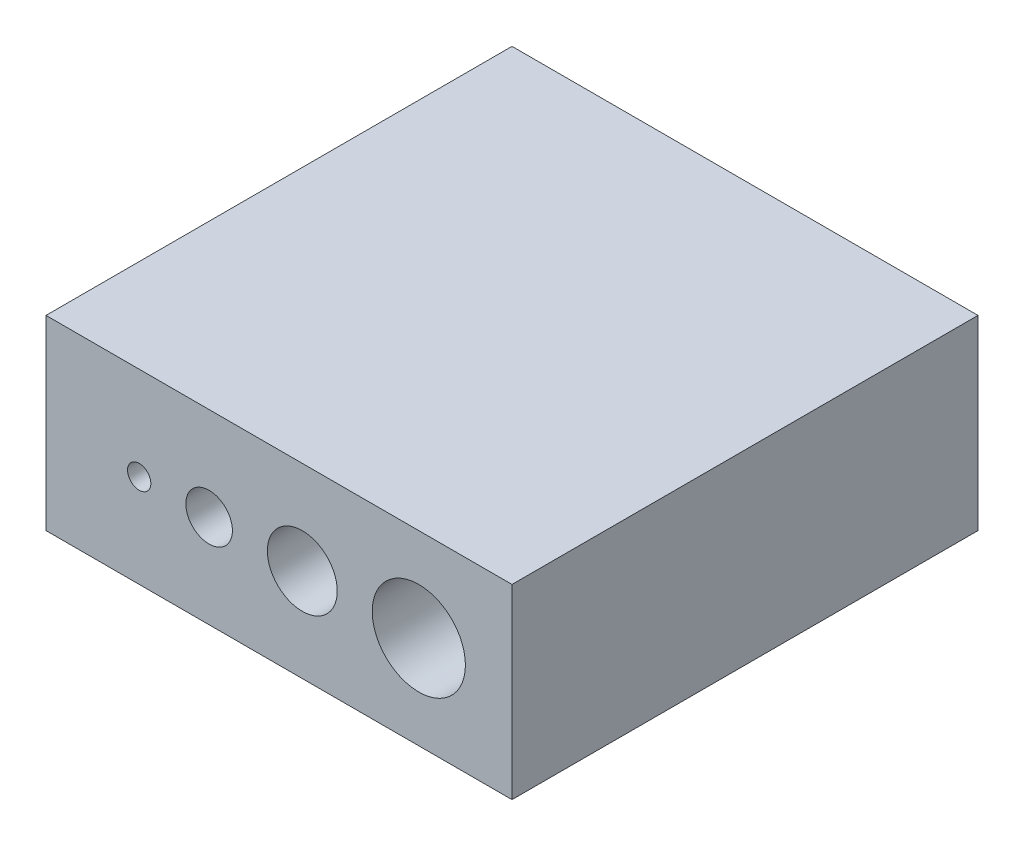
ISO-10303-21;
HEADER;
FILE_DESCRIPTION(('STEP AP214'),'2;1');
FILE_NAME('part.step','',(''),(''),'','','');
FILE_SCHEMA(('AUTOMOTIVE_DESIGN { 1 0 10303 214 1 1 1 1 }'));
ENDSEC;
DATA;
#1=APPLICATION_CONTEXT('core data for automotive mechanical design processes');
#2=APPLICATION_PROTOCOL_DEFINITION('international standard','automotive_design',2000,#1);
#3=PRODUCT_CONTEXT('',#1,'mechanical');
#4=PRODUCT('Part','Part','',(#3));
#5=PRODUCT_RELATED_PRODUCT_CATEGORY('part','',(#4));
#6=PRODUCT_DEFINITION_FORMATION('','',#4);
#7=PRODUCT_DEFINITION_CONTEXT('part definition',#1,'design');
#8=PRODUCT_DEFINITION('design','',#6,#7);
#9=PRODUCT_DEFINITION_SHAPE('','',#8);
#10=(LENGTH_UNIT() NAMED_UNIT(*) SI_UNIT(.MILLI.,.METRE.));
#11=(NAMED_UNIT(*) PLANE_ANGLE_UNIT() SI_UNIT($,.RADIAN.));
#12=(NAMED_UNIT(*) SI_UNIT($,.STERADIAN.) SOLID_ANGLE_UNIT());
#13=UNCERTAINTY_MEASURE_WITH_UNIT(LENGTH_MEASURE(1.E-05),#10,'distance_accuracy_value','');
#14=(GEOMETRIC_REPRESENTATION_CONTEXT(3) GLOBAL_UNCERTAINTY_ASSIGNED_CONTEXT((#13)) GLOBAL_UNIT_ASSIGNED_CONTEXT((#10,
#11,#12)) REPRESENTATION_CONTEXT('',''));
#15=CARTESIAN_POINT('',(0.,0.,0.));
#16=DIRECTION('',(0.,0.,1.));
#17=DIRECTION('',(1.,0.,0.));
#18=AXIS2_PLACEMENT_3D('',#15,#16,#17);
#19=CARTESIAN_POINT('',(0.,0.,-20.));
#20=DIRECTION('',(-1.,0.,0.));
#21=DIRECTION('',(0.,0.,1.));
#22=AXIS2_PLACEMENT_3D('',#19,#20,#21);
#23=PLANE('',#22);
#24=DIRECTION('',(0.,-1.,0.));
#25=VECTOR('',#24,1.);
#26=CARTESIAN_POINT('',(0.,0.,0.));
#27=LINE('',#26,#25);
#28=CARTESIAN_POINT('',(0.,8.,0.));
#29=VERTEX_POINT('',#28);
#30=CARTESIAN_POINT('',(0.,0.,0.));
#31=VERTEX_POINT('',#30);
#32=EDGE_CURVE('E98',#29,#31,#27,.T.);
#33=ORIENTED_EDGE('',*,*,#32,.F.);
#34=DIRECTION('',(0.,0.,1.));
#35=VECTOR('',#34,1.);
#36=CARTESIAN_POINT('',(0.,8.,-20.));
#37=LINE('',#36,#35);
#38=CARTESIAN_POINT('',(0.,8.,-20.));
#39=VERTEX_POINT('',#38);
#40=EDGE_CURVE('E11',#39,#29,#37,.T.);
#41=ORIENTED_EDGE('',*,*,#40,.F.);
#42=DIRECTION('',(0.,-1.,0.));
#43=VECTOR('',#42,1.);
#44=CARTESIAN_POINT('',(0.,0.,-20.));
#45=LINE('',#44,#43);
#46=CARTESIAN_POINT('',(0.,0.,-20.));
#47=VERTEX_POINT('',#46);
#48=EDGE_CURVE('E91',#39,#47,#45,.T.);
#49=ORIENTED_EDGE('',*,*,#48,.T.);
#50=DIRECTION('',(0.,0.,1.));
#51=VECTOR('',#50,1.);
#52=CARTESIAN_POINT('',(0.,0.,-20.));
#53=LINE('',#52,#51);
#54=EDGE_CURVE('E36',#47,#31,#53,.T.);
#55=ORIENTED_EDGE('',*,*,#54,.T.);
#56=EDGE_LOOP('',(#33,#41,#49,#55));
#57=FACE_BOUND('',#56,.T.);
#58=ADVANCED_FACE('F33',(#57),#23,.T.);
#59=CARTESIAN_POINT('',(0.,8.,-20.));
#60=DIRECTION('',(0.,1.,0.));
#61=DIRECTION('',(0.,0.,1.));
#62=AXIS2_PLACEMENT_3D('',#59,#60,#61);
#63=PLANE('',#62);
#64=DIRECTION('',(-1.,0.,0.));
#65=VECTOR('',#64,1.);
#66=CARTESIAN_POINT('',(0.,8.,0.));
#67=LINE('',#66,#65);
#68=CARTESIAN_POINT('',(20.,8.,0.));
#69=VERTEX_POINT('',#68);
#70=EDGE_CURVE('E93',#69,#29,#67,.T.);
#71=ORIENTED_EDGE('',*,*,#70,.F.);
#72=DIRECTION('',(0.,0.,1.));
#73=VECTOR('',#72,1.);
#74=CARTESIAN_POINT('',(20.,8.,-20.));
#75=LINE('',#74,#73);
#76=CARTESIAN_POINT('',(20.,8.,-20.));
#77=VERTEX_POINT('',#76);
#78=EDGE_CURVE('E42',#77,#69,#75,.T.);
#79=ORIENTED_EDGE('',*,*,#78,.F.);
#80=DIRECTION('',(-1.,0.,0.));
#81=VECTOR('',#80,1.);
#82=CARTESIAN_POINT('',(0.,8.,-20.));
#83=LINE('',#82,#81);
#84=EDGE_CURVE('E88',#77,#39,#83,.T.);
#85=ORIENTED_EDGE('',*,*,#84,.T.);
#86=ORIENTED_EDGE('',*,*,#40,.T.);
#87=EDGE_LOOP('',(#71,#79,#85,#86));
#88=FACE_BOUND('',#87,.T.);
#89=ADVANCED_FACE('F109',(#88),#63,.T.);
#90=CARTESIAN_POINT('',(20.,0.,-20.));
#91=DIRECTION('',(1.,0.,0.));
#92=DIRECTION('',(0.,0.,-1.));
#93=AXIS2_PLACEMENT_3D('',#90,#91,#92);
#94=PLANE('',#93);
#95=DIRECTION('',(0.,1.,0.));
#96=VECTOR('',#95,1.);
#97=CARTESIAN_POINT('',(20.,0.,0.));
#98=LINE('',#97,#96);
#99=CARTESIAN_POINT('',(20.,0.,0.));
#100=VERTEX_POINT('',#99);
#101=EDGE_CURVE('E83',#100,#69,#98,.T.);
#102=ORIENTED_EDGE('',*,*,#101,.F.);
#103=DIRECTION('',(0.,0.,1.));
#104=VECTOR('',#103,1.);
#105=CARTESIAN_POINT('',(20.,0.,-20.));
#106=LINE('',#105,#104);
#107=CARTESIAN_POINT('',(20.,0.,-20.));
#108=VERTEX_POINT('',#107);
#109=EDGE_CURVE('E78',#108,#100,#106,.T.);
#110=ORIENTED_EDGE('',*,*,#109,.F.);
#111=DIRECTION('',(0.,1.,0.));
#112=VECTOR('',#111,1.);
#113=CARTESIAN_POINT('',(20.,0.,-20.));
#114=LINE('',#113,#112);
#115=EDGE_CURVE('E81',#108,#77,#114,.T.);
#116=ORIENTED_EDGE('',*,*,#115,.T.);
#117=ORIENTED_EDGE('',*,*,#78,.T.);
#118=EDGE_LOOP('',(#102,#110,#116,#117));
#119=FACE_BOUND('',#118,.T.);
#120=ADVANCED_FACE('F80',(#119),#94,.T.);
#121=CARTESIAN_POINT('',(0.,0.,-20.));
#122=DIRECTION('',(0.,-1.,0.));
#123=DIRECTION('',(0.,0.,-1.));
#124=AXIS2_PLACEMENT_3D('',#121,#122,#123);
#125=PLANE('',#124);
#126=DIRECTION('',(1.,0.,0.));
#127=VECTOR('',#126,1.);
#128=CARTESIAN_POINT('',(0.,0.,0.));
#129=LINE('',#128,#127);
#130=EDGE_CURVE('E101',#31,#100,#129,.T.);
#131=ORIENTED_EDGE('',*,*,#130,.F.);
#132=ORIENTED_EDGE('',*,*,#54,.F.);
#133=DIRECTION('',(1.,0.,0.));
#134=VECTOR('',#133,1.);
#135=CARTESIAN_POINT('',(0.,0.,-20.));
#136=LINE('',#135,#134);
#137=EDGE_CURVE('E87',#47,#108,#136,.T.);
#138=ORIENTED_EDGE('',*,*,#137,.T.);
#139=ORIENTED_EDGE('',*,*,#109,.T.);
#140=EDGE_LOOP('',(#131,#132,#138,#139));
#141=FACE_BOUND('',#140,.T.);
#142=ADVANCED_FACE('F90',(#141),#125,.T.);
#143=CARTESIAN_POINT('',(0.,0.,-20.));
#144=DIRECTION('',(0.,0.,-1.));
#145=DIRECTION('',(-1.,0.,0.));
#146=AXIS2_PLACEMENT_3D('',#143,#144,#145);
#147=PLANE('',#146);
#148=CARTESIAN_POINT('',(4.,4.,-20.));
#149=DIRECTION('',(0.,0.,1.));
#150=DIRECTION('',(1.,0.,0.));
#151=AXIS2_PLACEMENT_3D('',#148,#149,#150);
#152=CIRCLE('',#151,0.500000000000001);
#153=CARTESIAN_POINT('',(4.5,4.,-20.));
#154=VERTEX_POINT('',#153);
#155=EDGE_CURVE('E102',#154,#154,#152,.T.);
#156=ORIENTED_EDGE('',*,*,#155,.T.);
#157=EDGE_LOOP('',(#156));
#158=FACE_BOUND('',#157,.T.);
#159=CARTESIAN_POINT('',(7.,4.,-20.));
#160=DIRECTION('',(0.,0.,1.));
#161=DIRECTION('',(1.,0.,0.));
#162=AXIS2_PLACEMENT_3D('',#159,#160,#161);
#163=CIRCLE('',#162,1.);
#164=CARTESIAN_POINT('',(8.,4.,-20.));
#165=VERTEX_POINT('',#164);
#166=EDGE_CURVE('E153',#165,#165,#163,.T.);
#167=ORIENTED_EDGE('',*,*,#166,.T.);
#168=EDGE_LOOP('',(#167));
#169=FACE_BOUND('',#168,.T.);
#170=CARTESIAN_POINT('',(11.,4.,-20.));
#171=DIRECTION('',(0.,0.,1.));
#172=DIRECTION('',(1.,0.,0.));
#173=AXIS2_PLACEMENT_3D('',#170,#171,#172);
#174=CIRCLE('',#173,1.5);
#175=CARTESIAN_POINT('',(12.5,4.,-20.));
#176=VERTEX_POINT('',#175);
#177=EDGE_CURVE('E162',#176,#176,#174,.T.);
#178=ORIENTED_EDGE('',*,*,#177,.T.);
#179=EDGE_LOOP('',(#178));
#180=FACE_BOUND('',#179,.T.);
#181=CARTESIAN_POINT('',(16.,4.,-20.));
#182=DIRECTION('',(0.,0.,1.));
#183=DIRECTION('',(1.,0.,0.));
#184=AXIS2_PLACEMENT_3D('',#181,#182,#183);
#185=CIRCLE('',#184,2.);
#186=CARTESIAN_POINT('',(18.,4.,-20.));
#187=VERTEX_POINT('',#186);
#188=EDGE_CURVE('E168',#187,#187,#185,.T.);
#189=ORIENTED_EDGE('',*,*,#188,.T.);
#190=EDGE_LOOP('',(#189));
#191=FACE_BOUND('',#190,.T.);
#192=ORIENTED_EDGE('',*,*,#48,.F.);
#193=ORIENTED_EDGE('',*,*,#84,.F.);
#194=ORIENTED_EDGE('',*,*,#115,.F.);
#195=ORIENTED_EDGE('',*,*,#137,.F.);
#196=EDGE_LOOP('',(#192,#193,#194,#195));
#197=FACE_BOUND('',#196,.T.);
#198=ADVANCED_FACE('F86',(#158,#169,#180,#191,#197),#147,.T.);
#199=CARTESIAN_POINT('',(0.,0.,0.));
#200=DIRECTION('',(0.,0.,-1.));
#201=DIRECTION('',(-1.,0.,0.));
#202=AXIS2_PLACEMENT_3D('',#199,#200,#201);
#203=PLANE('',#202);
#204=CARTESIAN_POINT('',(4.,4.,0.));
#205=DIRECTION('',(0.,0.,1.));
#206=DIRECTION('',(1.,0.,0.));
#207=AXIS2_PLACEMENT_3D('',#204,#205,#206);
#208=CIRCLE('',#207,0.500000000000001);
#209=CARTESIAN_POINT('',(4.5,4.,0.));
#210=VERTEX_POINT('',#209);
#211=EDGE_CURVE('E152',#210,#210,#208,.T.);
#212=ORIENTED_EDGE('',*,*,#211,.F.);
#213=EDGE_LOOP('',(#212));
#214=FACE_BOUND('',#213,.T.);
#215=CARTESIAN_POINT('',(7.,4.,0.));
#216=DIRECTION('',(0.,0.,1.));
#217=DIRECTION('',(1.,0.,0.));
#218=AXIS2_PLACEMENT_3D('',#215,#216,#217);
#219=CIRCLE('',#218,1.);
#220=CARTESIAN_POINT('',(8.,4.,0.));
#221=VERTEX_POINT('',#220);
#222=EDGE_CURVE('E157',#221,#221,#219,.T.);
#223=ORIENTED_EDGE('',*,*,#222,.F.);
#224=EDGE_LOOP('',(#223));
#225=FACE_BOUND('',#224,.T.);
#226=CARTESIAN_POINT('',(11.,4.,0.));
#227=DIRECTION('',(0.,0.,1.));
#228=DIRECTION('',(1.,0.,0.));
#229=AXIS2_PLACEMENT_3D('',#226,#227,#228);
#230=CIRCLE('',#229,1.5);
#231=CARTESIAN_POINT('',(12.5,4.,0.));
#232=VERTEX_POINT('',#231);
#233=EDGE_CURVE('E165',#232,#232,#230,.T.);
#234=ORIENTED_EDGE('',*,*,#233,.F.);
#235=EDGE_LOOP('',(#234));
#236=FACE_BOUND('',#235,.T.);
#237=CARTESIAN_POINT('',(16.,4.,0.));
#238=DIRECTION('',(0.,0.,1.));
#239=DIRECTION('',(1.,0.,0.));
#240=AXIS2_PLACEMENT_3D('',#237,#238,#239);
#241=CIRCLE('',#240,2.);
#242=CARTESIAN_POINT('',(18.,4.,0.));
#243=VERTEX_POINT('',#242);
#244=EDGE_CURVE('E170',#243,#243,#241,.T.);
#245=ORIENTED_EDGE('',*,*,#244,.F.);
#246=EDGE_LOOP('',(#245));
#247=FACE_BOUND('',#246,.T.);
#248=ORIENTED_EDGE('',*,*,#32,.T.);
#249=ORIENTED_EDGE('',*,*,#130,.T.);
#250=ORIENTED_EDGE('',*,*,#101,.T.);
#251=ORIENTED_EDGE('',*,*,#70,.T.);
#252=EDGE_LOOP('',(#248,#249,#250,#251));
#253=FACE_BOUND('',#252,.T.);
#254=ADVANCED_FACE('F108',(#214,#225,#236,#247,#253),#203,.F.);
#255=CARTESIAN_POINT('',(16.,4.,-20.));
#256=DIRECTION('',(0.,0.,1.));
#257=DIRECTION('',(1.,0.,0.));
#258=AXIS2_PLACEMENT_3D('',#255,#256,#257);
#259=CYLINDRICAL_SURFACE('',#258,2.);
#260=ORIENTED_EDGE('',*,*,#188,.F.);
#261=EDGE_LOOP('',(#260));
#262=FACE_BOUND('',#261,.T.);
#263=ORIENTED_EDGE('',*,*,#244,.T.);
#264=EDGE_LOOP('',(#263));
#265=FACE_BOUND('',#264,.T.);
#266=ADVANCED_FACE('F127',(#262,#265),#259,.F.);
#267=CARTESIAN_POINT('',(11.,4.,-20.));
#268=DIRECTION('',(0.,0.,1.));
#269=DIRECTION('',(1.,0.,0.));
#270=AXIS2_PLACEMENT_3D('',#267,#268,#269);
#271=CYLINDRICAL_SURFACE('',#270,1.5);
#272=ORIENTED_EDGE('',*,*,#177,.F.);
#273=EDGE_LOOP('',(#272));
#274=FACE_BOUND('',#273,.T.);
#275=ORIENTED_EDGE('',*,*,#233,.T.);
#276=EDGE_LOOP('',(#275));
#277=FACE_BOUND('',#276,.T.);
#278=ADVANCED_FACE('F134',(#274,#277),#271,.F.);
#279=CARTESIAN_POINT('',(7.,4.,-20.));
#280=DIRECTION('',(0.,0.,1.));
#281=DIRECTION('',(1.,0.,0.));
#282=AXIS2_PLACEMENT_3D('',#279,#280,#281);
#283=CYLINDRICAL_SURFACE('',#282,1.);
#284=ORIENTED_EDGE('',*,*,#166,.F.);
#285=EDGE_LOOP('',(#284));
#286=FACE_BOUND('',#285,.T.);
#287=ORIENTED_EDGE('',*,*,#222,.T.);
#288=EDGE_LOOP('',(#287));
#289=FACE_BOUND('',#288,.T.);
#290=ADVANCED_FACE('F138',(#286,#289),#283,.F.);
#291=CARTESIAN_POINT('',(4.,4.,-20.));
#292=DIRECTION('',(0.,0.,1.));
#293=DIRECTION('',(1.,0.,0.));
#294=AXIS2_PLACEMENT_3D('',#291,#292,#293);
#295=CYLINDRICAL_SURFACE('',#294,0.500000000000001);
#296=ORIENTED_EDGE('',*,*,#155,.F.);
#297=EDGE_LOOP('',(#296));
#298=FACE_BOUND('',#297,.T.);
#299=ORIENTED_EDGE('',*,*,#211,.T.);
#300=EDGE_LOOP('',(#299));
#301=FACE_BOUND('',#300,.T.);
#302=ADVANCED_FACE('F142',(#298,#301),#295,.F.);
#303=CLOSED_SHELL('',(#58,#89,#120,#142,#198,#254,#266,#278,#290,#302));
#304=MANIFOLD_SOLID_BREP('B2',#303);
#305=ADVANCED_BREP_SHAPE_REPRESENTATION('',(#18,#304),#14);
#306=SHAPE_DEFINITION_REPRESENTATION(#9,#305);
ENDSEC;
END-ISO-10303-21;
